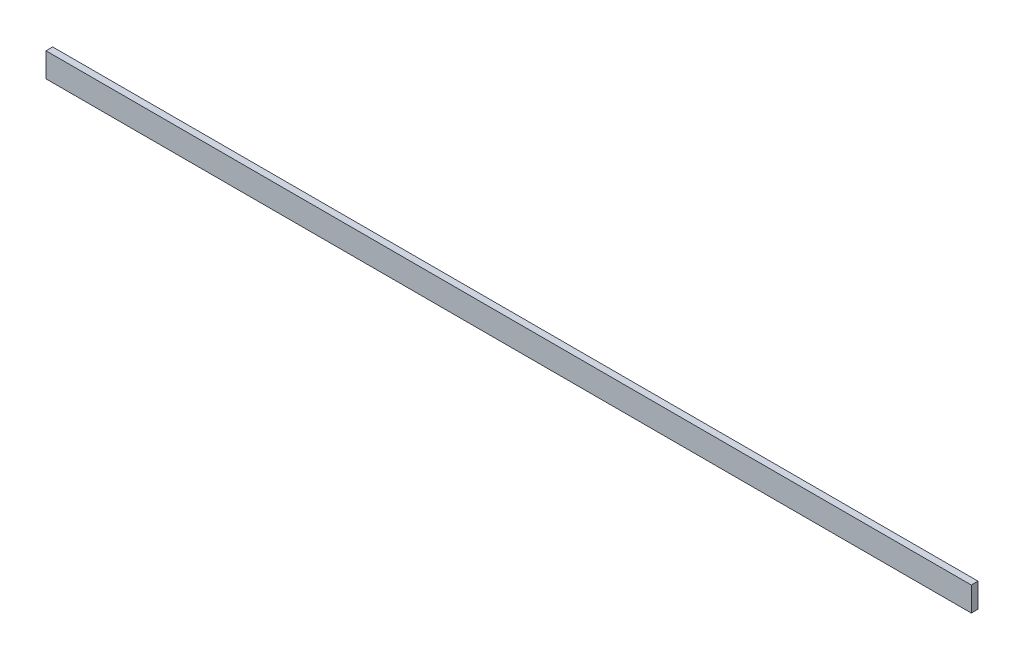
ISO-10303-21;
HEADER;
FILE_DESCRIPTION(('STEP AP214'),'2;1');
FILE_NAME('part.step','',(''),(''),'','','');
FILE_SCHEMA(('AUTOMOTIVE_DESIGN { 1 0 10303 214 1 1 1 1 }'));
ENDSEC;
DATA;
#1=APPLICATION_CONTEXT('core data for automotive mechanical design processes');
#2=APPLICATION_PROTOCOL_DEFINITION('international standard','automotive_design',2000,#1);
#3=PRODUCT_CONTEXT('',#1,'mechanical');
#4=PRODUCT('Part','Part','',(#3));
#5=PRODUCT_RELATED_PRODUCT_CATEGORY('part','',(#4));
#6=PRODUCT_DEFINITION_FORMATION('','',#4);
#7=PRODUCT_DEFINITION_CONTEXT('part definition',#1,'design');
#8=PRODUCT_DEFINITION('design','',#6,#7);
#9=PRODUCT_DEFINITION_SHAPE('','',#8);
#10=(LENGTH_UNIT() NAMED_UNIT(*) SI_UNIT(.MILLI.,.METRE.));
#11=(NAMED_UNIT(*) PLANE_ANGLE_UNIT() SI_UNIT($,.RADIAN.));
#12=(NAMED_UNIT(*) SI_UNIT($,.STERADIAN.) SOLID_ANGLE_UNIT());
#13=UNCERTAINTY_MEASURE_WITH_UNIT(LENGTH_MEASURE(1.E-05),#10,'distance_accuracy_value','');
#14=(GEOMETRIC_REPRESENTATION_CONTEXT(3) GLOBAL_UNCERTAINTY_ASSIGNED_CONTEXT((#13)) GLOBAL_UNIT_ASSIGNED_CONTEXT((#10,
#11,#12)) REPRESENTATION_CONTEXT('',''));
#15=CARTESIAN_POINT('',(0.,0.,0.));
#16=DIRECTION('',(0.,0.,1.));
#17=DIRECTION('',(1.,0.,0.));
#18=AXIS2_PLACEMENT_3D('',#15,#16,#17);
#19=CARTESIAN_POINT('',(0.,0.,22.));
#20=DIRECTION('',(1.,0.,0.));
#21=DIRECTION('',(0.,0.,-1.));
#22=AXIS2_PLACEMENT_3D('',#19,#20,#21);
#23=PLANE('',#22);
#24=DIRECTION('',(0.,-1.,0.));
#25=VECTOR('',#24,1.);
#26=CARTESIAN_POINT('',(0.,0.,0.));
#27=LINE('',#26,#25);
#28=CARTESIAN_POINT('',(0.,80.,0.));
#29=VERTEX_POINT('',#28);
#30=CARTESIAN_POINT('',(0.,0.,0.));
#31=VERTEX_POINT('',#30);
#32=EDGE_CURVE('E94',#29,#31,#27,.T.);
#33=ORIENTED_EDGE('',*,*,#32,.T.);
#34=DIRECTION('',(0.,0.,-1.));
#35=VECTOR('',#34,1.);
#36=CARTESIAN_POINT('',(0.,0.,22.));
#37=LINE('',#36,#35);
#38=CARTESIAN_POINT('',(0.,0.,22.));
#39=VERTEX_POINT('',#38);
#40=EDGE_CURVE('E11',#39,#31,#37,.T.);
#41=ORIENTED_EDGE('',*,*,#40,.F.);
#42=DIRECTION('',(0.,-1.,0.));
#43=VECTOR('',#42,1.);
#44=CARTESIAN_POINT('',(0.,0.,22.));
#45=LINE('',#44,#43);
#46=CARTESIAN_POINT('',(0.,80.,22.));
#47=VERTEX_POINT('',#46);
#48=EDGE_CURVE('E82',#47,#39,#45,.T.);
#49=ORIENTED_EDGE('',*,*,#48,.F.);
#50=DIRECTION('',(0.,0.,-1.));
#51=VECTOR('',#50,1.);
#52=CARTESIAN_POINT('',(0.,80.,22.));
#53=LINE('',#52,#51);
#54=EDGE_CURVE('E90',#47,#29,#53,.T.);
#55=ORIENTED_EDGE('',*,*,#54,.T.);
#56=EDGE_LOOP('',(#33,#41,#49,#55));
#57=FACE_BOUND('',#56,.T.);
#58=ADVANCED_FACE('F31',(#57),#23,.F.);
#59=CARTESIAN_POINT('',(0.,0.,22.));
#60=DIRECTION('',(0.,1.,0.));
#61=DIRECTION('',(0.,0.,1.));
#62=AXIS2_PLACEMENT_3D('',#59,#60,#61);
#63=PLANE('',#62);
#64=DIRECTION('',(1.,0.,0.));
#65=VECTOR('',#64,1.);
#66=CARTESIAN_POINT('',(0.,0.,0.));
#67=LINE('',#66,#65);
#68=CARTESIAN_POINT('',(3044.,0.,0.));
#69=VERTEX_POINT('',#68);
#70=EDGE_CURVE('E86',#31,#69,#67,.T.);
#71=ORIENTED_EDGE('',*,*,#70,.T.);
#72=DIRECTION('',(0.,0.,-1.));
#73=VECTOR('',#72,1.);
#74=CARTESIAN_POINT('',(3044.,0.,22.));
#75=LINE('',#74,#73);
#76=CARTESIAN_POINT('',(3044.,0.,22.));
#77=VERTEX_POINT('',#76);
#78=EDGE_CURVE('E39',#77,#69,#75,.T.);
#79=ORIENTED_EDGE('',*,*,#78,.F.);
#80=DIRECTION('',(1.,0.,0.));
#81=VECTOR('',#80,1.);
#82=CARTESIAN_POINT('',(0.,0.,22.));
#83=LINE('',#82,#81);
#84=EDGE_CURVE('E77',#39,#77,#83,.T.);
#85=ORIENTED_EDGE('',*,*,#84,.F.);
#86=ORIENTED_EDGE('',*,*,#40,.T.);
#87=EDGE_LOOP('',(#71,#79,#85,#86));
#88=FACE_BOUND('',#87,.T.);
#89=ADVANCED_FACE('F85',(#88),#63,.F.);
#90=CARTESIAN_POINT('',(3044.,0.,22.));
#91=DIRECTION('',(-1.,0.,0.));
#92=DIRECTION('',(0.,0.,1.));
#93=AXIS2_PLACEMENT_3D('',#90,#91,#92);
#94=PLANE('',#93);
#95=DIRECTION('',(0.,1.,0.));
#96=VECTOR('',#95,1.);
#97=CARTESIAN_POINT('',(3044.,0.,0.));
#98=LINE('',#97,#96);
#99=CARTESIAN_POINT('',(3044.,80.,0.));
#100=VERTEX_POINT('',#99);
#101=EDGE_CURVE('E64',#69,#100,#98,.T.);
#102=ORIENTED_EDGE('',*,*,#101,.T.);
#103=DIRECTION('',(0.,0.,-1.));
#104=VECTOR('',#103,1.);
#105=CARTESIAN_POINT('',(3044.,80.,22.));
#106=LINE('',#105,#104);
#107=CARTESIAN_POINT('',(3044.,80.,22.));
#108=VERTEX_POINT('',#107);
#109=EDGE_CURVE('E87',#108,#100,#106,.T.);
#110=ORIENTED_EDGE('',*,*,#109,.F.);
#111=DIRECTION('',(0.,1.,0.));
#112=VECTOR('',#111,1.);
#113=CARTESIAN_POINT('',(3044.,0.,22.));
#114=LINE('',#113,#112);
#115=EDGE_CURVE('E80',#77,#108,#114,.T.);
#116=ORIENTED_EDGE('',*,*,#115,.F.);
#117=ORIENTED_EDGE('',*,*,#78,.T.);
#118=EDGE_LOOP('',(#102,#110,#116,#117));
#119=FACE_BOUND('',#118,.T.);
#120=ADVANCED_FACE('F88',(#119),#94,.F.);
#121=CARTESIAN_POINT('',(0.,80.,22.));
#122=DIRECTION('',(0.,-1.,0.));
#123=DIRECTION('',(0.,0.,-1.));
#124=AXIS2_PLACEMENT_3D('',#121,#122,#123);
#125=PLANE('',#124);
#126=DIRECTION('',(-1.,0.,0.));
#127=VECTOR('',#126,1.);
#128=CARTESIAN_POINT('',(0.,80.,0.));
#129=LINE('',#128,#127);
#130=EDGE_CURVE('E70',#100,#29,#129,.T.);
#131=ORIENTED_EDGE('',*,*,#130,.T.);
#132=ORIENTED_EDGE('',*,*,#54,.F.);
#133=DIRECTION('',(-1.,0.,0.));
#134=VECTOR('',#133,1.);
#135=CARTESIAN_POINT('',(0.,80.,22.));
#136=LINE('',#135,#134);
#137=EDGE_CURVE('E47',#108,#47,#136,.T.);
#138=ORIENTED_EDGE('',*,*,#137,.F.);
#139=ORIENTED_EDGE('',*,*,#109,.T.);
#140=EDGE_LOOP('',(#131,#132,#138,#139));
#141=FACE_BOUND('',#140,.T.);
#142=ADVANCED_FACE('F101',(#141),#125,.F.);
#143=CARTESIAN_POINT('',(0.,80.,22.));
#144=DIRECTION('',(0.,0.,-1.));
#145=DIRECTION('',(-1.,0.,0.));
#146=AXIS2_PLACEMENT_3D('',#143,#144,#145);
#147=PLANE('',#146);
#148=ORIENTED_EDGE('',*,*,#48,.T.);
#149=ORIENTED_EDGE('',*,*,#84,.T.);
#150=ORIENTED_EDGE('',*,*,#115,.T.);
#151=ORIENTED_EDGE('',*,*,#137,.T.);
#152=EDGE_LOOP('',(#148,#149,#150,#151));
#153=FACE_BOUND('',#152,.T.);
#154=ADVANCED_FACE('F78',(#153),#147,.F.);
#155=CARTESIAN_POINT('',(0.,80.,0.));
#156=DIRECTION('',(0.,0.,-1.));
#157=DIRECTION('',(-1.,0.,0.));
#158=AXIS2_PLACEMENT_3D('',#155,#156,#157);
#159=PLANE('',#158);
#160=ORIENTED_EDGE('',*,*,#32,.F.);
#161=ORIENTED_EDGE('',*,*,#130,.F.);
#162=ORIENTED_EDGE('',*,*,#101,.F.);
#163=ORIENTED_EDGE('',*,*,#70,.F.);
#164=EDGE_LOOP('',(#160,#161,#162,#163));
#165=FACE_BOUND('',#164,.T.);
#166=ADVANCED_FACE('F104',(#165),#159,.T.);
#167=CLOSED_SHELL('',(#58,#89,#120,#142,#154,#166));
#168=MANIFOLD_SOLID_BREP('B2',#167);
#169=ADVANCED_BREP_SHAPE_REPRESENTATION('',(#18,#168),#14);
#170=SHAPE_DEFINITION_REPRESENTATION(#9,#169);
ENDSEC;
END-ISO-10303-21;
